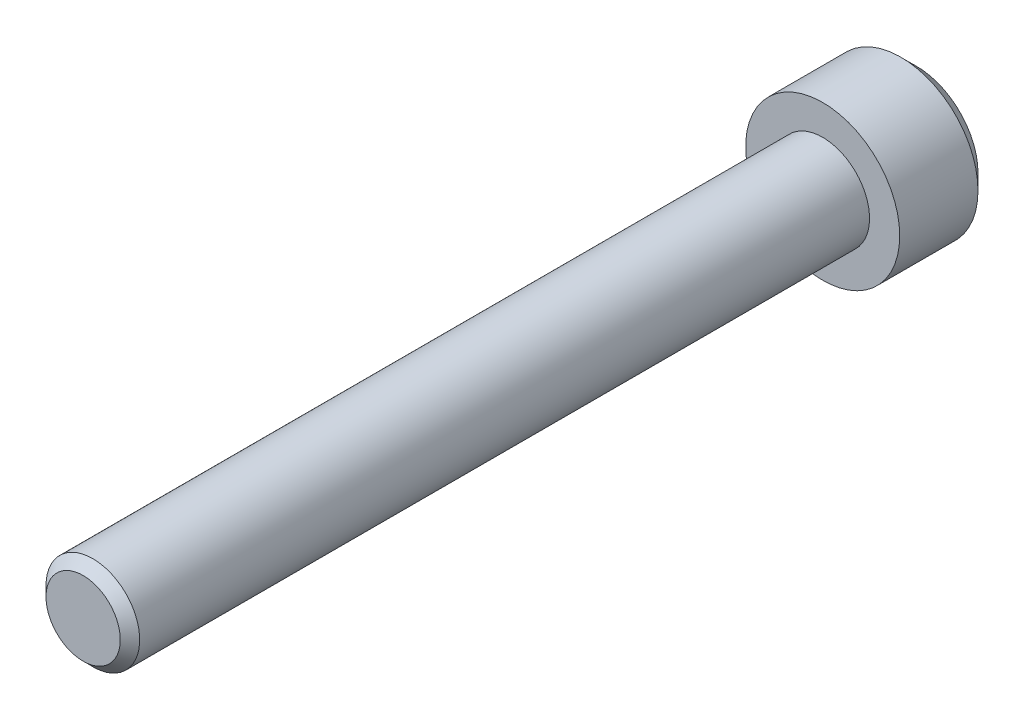
ISO-10303-21;
HEADER;
FILE_DESCRIPTION(('STEP AP214'),'2;1');
FILE_NAME('part.step','',(''),(''),'','','');
FILE_SCHEMA(('AUTOMOTIVE_DESIGN { 1 0 10303 214 1 1 1 1 }'));
ENDSEC;
DATA;
#1=APPLICATION_CONTEXT('core data for automotive mechanical design processes');
#2=APPLICATION_PROTOCOL_DEFINITION('international standard','automotive_design',2000,#1);
#3=PRODUCT_CONTEXT('',#1,'mechanical');
#4=PRODUCT('Part','Part','',(#3));
#5=PRODUCT_RELATED_PRODUCT_CATEGORY('part','',(#4));
#6=PRODUCT_DEFINITION_FORMATION('','',#4);
#7=PRODUCT_DEFINITION_CONTEXT('part definition',#1,'design');
#8=PRODUCT_DEFINITION('design','',#6,#7);
#9=PRODUCT_DEFINITION_SHAPE('','',#8);
#10=(LENGTH_UNIT() NAMED_UNIT(*) SI_UNIT(.MILLI.,.METRE.));
#11=(NAMED_UNIT(*) PLANE_ANGLE_UNIT() SI_UNIT($,.RADIAN.));
#12=(NAMED_UNIT(*) SI_UNIT($,.STERADIAN.) SOLID_ANGLE_UNIT());
#13=UNCERTAINTY_MEASURE_WITH_UNIT(LENGTH_MEASURE(1.E-05),#10,'distance_accuracy_value','');
#14=(GEOMETRIC_REPRESENTATION_CONTEXT(3) GLOBAL_UNCERTAINTY_ASSIGNED_CONTEXT((#13)) GLOBAL_UNIT_ASSIGNED_CONTEXT((#10,
#11,#12)) REPRESENTATION_CONTEXT('',''));
#15=CARTESIAN_POINT('',(0.,0.,0.));
#16=DIRECTION('',(0.,0.,1.));
#17=DIRECTION('',(1.,0.,0.));
#18=AXIS2_PLACEMENT_3D('',#15,#16,#17);
#19=CARTESIAN_POINT('',(75.6412,46.355,-54.2417));
#20=DIRECTION('',(0.,0.,1.));
#21=DIRECTION('',(1.,0.,0.));
#22=AXIS2_PLACEMENT_3D('',#19,#20,#21);
#23=PLANE('',#22);
#24=DIRECTION('',(0.608447428642477,0.793594182550728,0.));
#25=VECTOR('',#24,1.);
#26=CARTESIAN_POINT('',(77.2159884559992,45.1476121337877,-54.2417));
#27=LINE('',#26,#25);
#28=CARTESIAN_POINT('',(77.9130741655732,46.0568166727753,-54.2417));
#29=VERTEX_POINT('',#28);
#30=CARTESIAN_POINT('',(76.5189027464251,44.2384075947999,-54.2417));
#31=VERTEX_POINT('',#30);
#32=EDGE_CURVE('E131',#29,#31,#27,.F.);
#33=ORIENTED_EDGE('',*,*,#32,.T.);
#34=DIRECTION('',(0.991496436705714,-0.13013383879634,0.));
#35=VECTOR('',#34,1.);
#36=CARTESIAN_POINT('',(75.3829656636386,44.3874992584122,-54.2417));
#37=LINE('',#36,#35);
#38=CARTESIAN_POINT('',(74.2470285808521,44.5365909220243,-54.2417));
#39=VERTEX_POINT('',#38);
#40=EDGE_CURVE('E135',#31,#39,#37,.F.);
#41=ORIENTED_EDGE('',*,*,#40,.T.);
#42=DIRECTION('',(0.383049008063238,-0.923728021347068,0.));
#43=VECTOR('',#42,1.);
#44=CARTESIAN_POINT('',(73.8081772076394,45.5948871246245,-54.2417));
#45=LINE('',#44,#43);
#46=CARTESIAN_POINT('',(73.369325834427,46.6531833272247,-54.2417));
#47=VERTEX_POINT('',#46);
#48=EDGE_CURVE('E83',#39,#47,#45,.F.);
#49=ORIENTED_EDGE('',*,*,#48,.T.);
#50=DIRECTION('',(-0.608447428642477,-0.793594182550728,0.));
#51=VECTOR('',#50,1.);
#52=CARTESIAN_POINT('',(74.066411544001,47.5623878662123,-54.2417));
#53=LINE('',#52,#51);
#54=CARTESIAN_POINT('',(74.7634972535751,48.4715924052002,-54.2417));
#55=VERTEX_POINT('',#54);
#56=EDGE_CURVE('E66',#47,#55,#53,.F.);
#57=ORIENTED_EDGE('',*,*,#56,.T.);
#58=DIRECTION('',(-0.991496436705714,0.13013383879634,0.));
#59=VECTOR('',#58,1.);
#60=CARTESIAN_POINT('',(75.8994343363616,48.3225007415878,-54.2417));
#61=LINE('',#60,#59);
#62=CARTESIAN_POINT('',(77.0353714191481,48.1734090779756,-54.2417));
#63=VERTEX_POINT('',#62);
#64=EDGE_CURVE('E71',#55,#63,#61,.F.);
#65=ORIENTED_EDGE('',*,*,#64,.T.);
#66=DIRECTION('',(-0.383049008063237,0.923728021347068,0.));
#67=VECTOR('',#66,1.);
#68=CARTESIAN_POINT('',(77.4742227923606,47.1151128753755,-54.2417));
#69=LINE('',#68,#67);
#70=EDGE_CURVE('E127',#63,#29,#69,.F.);
#71=ORIENTED_EDGE('',*,*,#70,.T.);
#72=EDGE_LOOP('',(#33,#41,#49,#57,#65,#71));
#73=FACE_BOUND('',#72,.T.);
#74=ADVANCED_FACE('F16',(#73),#23,.F.);
#75=CARTESIAN_POINT('',(75.8994343363616,48.3225007415878,-55.3847));
#76=DIRECTION('',(0.13013383879634,0.991496436705714,0.));
#77=DIRECTION('',(-0.991496436705714,0.13013383879634,0.));
#78=AXIS2_PLACEMENT_3D('',#75,#76,#77);
#79=PLANE('',#78);
#80=DIRECTION('',(0.,0.,1.));
#81=VECTOR('',#80,1.);
#82=CARTESIAN_POINT('',(74.7634972535751,48.4715924052002,-55.3847));
#83=LINE('',#82,#81);
#84=CARTESIAN_POINT('',(74.7634972535751,48.4715924052002,-56.5277));
#85=VERTEX_POINT('',#84);
#86=EDGE_CURVE('E73',#55,#85,#83,.F.);
#87=ORIENTED_EDGE('',*,*,#86,.T.);
#88=DIRECTION('',(-0.991496436705721,0.13013383879629,0.));
#89=VECTOR('',#88,1.);
#90=CARTESIAN_POINT('',(77.0353714191482,48.1734090779757,-56.5277));
#91=LINE('',#90,#89);
#92=CARTESIAN_POINT('',(77.0353714191481,48.1734090779756,-56.5277));
#93=VERTEX_POINT('',#92);
#94=EDGE_CURVE('E125',#93,#85,#91,.T.);
#95=ORIENTED_EDGE('',*,*,#94,.F.);
#96=DIRECTION('',(0.,0.,1.));
#97=VECTOR('',#96,1.);
#98=CARTESIAN_POINT('',(77.035371419148,48.1734090779756,-55.3847));
#99=LINE('',#98,#97);
#100=EDGE_CURVE('E76',#93,#63,#99,.T.);
#101=ORIENTED_EDGE('',*,*,#100,.T.);
#102=ORIENTED_EDGE('',*,*,#64,.F.);
#103=EDGE_LOOP('',(#87,#95,#101,#102));
#104=FACE_BOUND('',#103,.T.);
#105=ADVANCED_FACE('F72',(#104),#79,.F.);
#106=CARTESIAN_POINT('',(74.066411544001,47.5623878662123,-55.3847));
#107=DIRECTION('',(-0.793594182550728,0.608447428642477,0.));
#108=DIRECTION('',(-0.608447428642477,-0.793594182550728,0.));
#109=AXIS2_PLACEMENT_3D('',#106,#107,#108);
#110=PLANE('',#109);
#111=DIRECTION('',(0.,0.,1.));
#112=VECTOR('',#111,1.);
#113=CARTESIAN_POINT('',(73.3693258344268,46.6531833272246,-55.3847));
#114=LINE('',#113,#112);
#115=CARTESIAN_POINT('',(73.369325834427,46.6531833272247,-56.5277));
#116=VERTEX_POINT('',#115);
#117=EDGE_CURVE('E85',#47,#116,#114,.F.);
#118=ORIENTED_EDGE('',*,*,#117,.T.);
#119=DIRECTION('',(-0.608447428642512,-0.793594182550701,0.));
#120=VECTOR('',#119,1.);
#121=CARTESIAN_POINT('',(74.7634972535751,48.4715924052002,-56.5277));
#122=LINE('',#121,#120);
#123=EDGE_CURVE('E89',#85,#116,#122,.T.);
#124=ORIENTED_EDGE('',*,*,#123,.F.);
#125=ORIENTED_EDGE('',*,*,#86,.F.);
#126=ORIENTED_EDGE('',*,*,#56,.F.);
#127=EDGE_LOOP('',(#118,#124,#125,#126));
#128=FACE_BOUND('',#127,.T.);
#129=ADVANCED_FACE('F87',(#128),#110,.F.);
#130=CARTESIAN_POINT('',(73.8081772076394,45.5948871246245,-55.3847));
#131=DIRECTION('',(-0.923728021347068,-0.383049008063238,0.));
#132=DIRECTION('',(0.383049008063238,-0.923728021347068,0.));
#133=AXIS2_PLACEMENT_3D('',#130,#131,#132);
#134=PLANE('',#133);
#135=DIRECTION('',(0.,0.,1.));
#136=VECTOR('',#135,1.);
#137=CARTESIAN_POINT('',(74.2470285808521,44.5365909220245,-55.3847));
#138=LINE('',#137,#136);
#139=CARTESIAN_POINT('',(74.2470285808521,44.5365909220243,-56.5277));
#140=VERTEX_POINT('',#139);
#141=EDGE_CURVE('E137',#39,#140,#138,.F.);
#142=ORIENTED_EDGE('',*,*,#141,.T.);
#143=DIRECTION('',(0.383049008063221,-0.923728021347075,0.));
#144=VECTOR('',#143,1.);
#145=CARTESIAN_POINT('',(73.369325834427,46.6531833272247,-56.5277));
#146=LINE('',#145,#144);
#147=EDGE_CURVE('E121',#116,#140,#146,.T.);
#148=ORIENTED_EDGE('',*,*,#147,.F.);
#149=ORIENTED_EDGE('',*,*,#117,.F.);
#150=ORIENTED_EDGE('',*,*,#48,.F.);
#151=EDGE_LOOP('',(#142,#148,#149,#150));
#152=FACE_BOUND('',#151,.T.);
#153=ADVANCED_FACE('F141',(#152),#134,.F.);
#154=CARTESIAN_POINT('',(75.3829656636386,44.3874992584122,-55.3847));
#155=DIRECTION('',(-0.13013383879634,-0.991496436705714,0.));
#156=DIRECTION('',(0.991496436705714,-0.13013383879634,0.));
#157=AXIS2_PLACEMENT_3D('',#154,#155,#156);
#158=PLANE('',#157);
#159=DIRECTION('',(0.,0.,1.));
#160=VECTOR('',#159,1.);
#161=CARTESIAN_POINT('',(76.5189027464251,44.2384075947998,-55.3847));
#162=LINE('',#161,#160);
#163=CARTESIAN_POINT('',(76.5189027464251,44.2384075947999,-56.5277));
#164=VERTEX_POINT('',#163);
#165=EDGE_CURVE('E133',#31,#164,#162,.F.);
#166=ORIENTED_EDGE('',*,*,#165,.T.);
#167=DIRECTION('',(0.99149643670572,-0.130133838796296,0.));
#168=VECTOR('',#167,1.);
#169=CARTESIAN_POINT('',(74.2470285808521,44.5365909220243,-56.5277));
#170=LINE('',#169,#168);
#171=EDGE_CURVE('E118',#140,#164,#170,.T.);
#172=ORIENTED_EDGE('',*,*,#171,.F.);
#173=ORIENTED_EDGE('',*,*,#141,.F.);
#174=ORIENTED_EDGE('',*,*,#40,.F.);
#175=EDGE_LOOP('',(#166,#172,#173,#174));
#176=FACE_BOUND('',#175,.T.);
#177=ADVANCED_FACE('F151',(#176),#158,.F.);
#178=CARTESIAN_POINT('',(77.2159884559992,45.1476121337877,-55.3847));
#179=DIRECTION('',(0.793594182550728,-0.608447428642477,0.));
#180=DIRECTION('',(0.608447428642477,0.793594182550728,0.));
#181=AXIS2_PLACEMENT_3D('',#178,#179,#180);
#182=PLANE('',#181);
#183=DIRECTION('',(0.,0.,1.));
#184=VECTOR('',#183,1.);
#185=CARTESIAN_POINT('',(77.9130741655732,46.0568166727753,-55.3847));
#186=LINE('',#185,#184);
#187=CARTESIAN_POINT('',(77.9130741655732,46.0568166727753,-56.5277));
#188=VERTEX_POINT('',#187);
#189=EDGE_CURVE('E34',#29,#188,#186,.F.);
#190=ORIENTED_EDGE('',*,*,#189,.T.);
#191=DIRECTION('',(0.608447428642539,0.79359418255068,0.));
#192=VECTOR('',#191,1.);
#193=CARTESIAN_POINT('',(76.5189027464251,44.2384075947998,-56.5277));
#194=LINE('',#193,#192);
#195=EDGE_CURVE('E115',#164,#188,#194,.T.);
#196=ORIENTED_EDGE('',*,*,#195,.F.);
#197=ORIENTED_EDGE('',*,*,#165,.F.);
#198=ORIENTED_EDGE('',*,*,#32,.F.);
#199=EDGE_LOOP('',(#190,#196,#197,#198));
#200=FACE_BOUND('',#199,.T.);
#201=ADVANCED_FACE('F149',(#200),#182,.F.);
#202=CARTESIAN_POINT('',(77.4742227923606,47.1151128753755,-55.3847));
#203=DIRECTION('',(0.923728021347068,0.383049008063237,0.));
#204=DIRECTION('',(-0.383049008063237,0.923728021347068,0.));
#205=AXIS2_PLACEMENT_3D('',#202,#203,#204);
#206=PLANE('',#205);
#207=ORIENTED_EDGE('',*,*,#100,.F.);
#208=DIRECTION('',(-0.383049008063216,0.923728021347077,0.));
#209=VECTOR('',#208,1.);
#210=CARTESIAN_POINT('',(77.9130741655733,46.0568166727753,-56.5277));
#211=LINE('',#210,#209);
#212=EDGE_CURVE('E106',#188,#93,#211,.T.);
#213=ORIENTED_EDGE('',*,*,#212,.F.);
#214=ORIENTED_EDGE('',*,*,#189,.F.);
#215=ORIENTED_EDGE('',*,*,#70,.F.);
#216=EDGE_LOOP('',(#207,#213,#214,#215));
#217=FACE_BOUND('',#216,.T.);
#218=ADVANCED_FACE('F147',(#217),#206,.F.);
#219=CARTESIAN_POINT('',(75.6412,46.355,-56.5277));
#220=DIRECTION('',(0.,0.,-1.));
#221=DIRECTION('',(-1.,0.,0.));
#222=AXIS2_PLACEMENT_3D('',#219,#220,#221);
#223=PLANE('',#222);
#224=CARTESIAN_POINT('',(75.6412,46.355,-56.5277000007427));
#225=DIRECTION('',(0.,0.,1.));
#226=DIRECTION('',(1.,0.,0.));
#227=AXIS2_PLACEMENT_3D('',#224,#225,#226);
#228=CIRCLE('',#227,3.17500000071682);
#229=CARTESIAN_POINT('',(78.8162000007168,46.355,-56.5277000007427));
#230=VERTEX_POINT('',#229);
#231=EDGE_CURVE('E19',#230,#230,#228,.T.);
#232=ORIENTED_EDGE('',*,*,#231,.F.);
#233=EDGE_LOOP('',(#232));
#234=FACE_BOUND('',#233,.T.);
#235=ORIENTED_EDGE('',*,*,#195,.T.);
#236=ORIENTED_EDGE('',*,*,#212,.T.);
#237=ORIENTED_EDGE('',*,*,#94,.T.);
#238=ORIENTED_EDGE('',*,*,#123,.T.);
#239=ORIENTED_EDGE('',*,*,#147,.T.);
#240=ORIENTED_EDGE('',*,*,#171,.T.);
#241=EDGE_LOOP('',(#235,#236,#237,#238,#239,#240));
#242=FACE_BOUND('',#241,.T.);
#243=ADVANCED_FACE('F145',(#234,#242),#223,.T.);
#244=CARTESIAN_POINT('',(75.6412,46.355,-55.7339500002172));
#245=DIRECTION('',(0.,0.,1.));
#246=DIRECTION('',(1.,0.,0.));
#247=AXIS2_PLACEMENT_3D('',#244,#245,#246);
#248=CONICAL_SURFACE('',#247,3.96874999982188,0.785398162502687);
#249=CARTESIAN_POINT('',(75.6412,46.355,-55.73395));
#250=DIRECTION('',(0.,0.,1.));
#251=DIRECTION('',(1.,0.,0.));
#252=AXIS2_PLACEMENT_3D('',#249,#250,#251);
#253=CIRCLE('',#252,3.96875);
#254=CARTESIAN_POINT('',(79.60995,46.355,-55.73395));
#255=VERTEX_POINT('',#254);
#256=EDGE_CURVE('E98',#255,#255,#253,.T.);
#257=ORIENTED_EDGE('',*,*,#256,.F.);
#258=EDGE_LOOP('',(#257));
#259=FACE_BOUND('',#258,.T.);
#260=ORIENTED_EDGE('',*,*,#231,.T.);
#261=EDGE_LOOP('',(#260));
#262=FACE_BOUND('',#261,.T.);
#263=ADVANCED_FACE('F182',(#259,#262),#248,.T.);
#264=CARTESIAN_POINT('',(117.726911175833,59.055,-13.6017));
#265=DIRECTION('',(0.,0.,-1.));
#266=DIRECTION('',(0.,1.,0.));
#267=AXIS2_PLACEMENT_3D('',#264,#265,#266);
#268=PLANE('',#267);
#269=CARTESIAN_POINT('',(75.6412,46.355,-13.6017000000379));
#270=DIRECTION('',(0.,0.,-1.));
#271=DIRECTION('',(-1.,0.,0.));
#272=AXIS2_PLACEMENT_3D('',#269,#270,#271);
#273=CIRCLE('',#272,1.91300000005183);
#274=CARTESIAN_POINT('',(73.7281999999482,46.355,-13.6017000000379));
#275=VERTEX_POINT('',#274);
#276=EDGE_CURVE('E96',#275,#275,#273,.T.);
#277=ORIENTED_EDGE('',*,*,#276,.F.);
#278=EDGE_LOOP('',(#277));
#279=FACE_BOUND('',#278,.T.);
#280=ADVANCED_FACE('F179',(#279),#268,.F.);
#281=CARTESIAN_POINT('',(75.6412,46.355,-51.7017));
#282=DIRECTION('',(0.,0.,1.));
#283=DIRECTION('',(1.,0.,0.));
#284=AXIS2_PLACEMENT_3D('',#281,#282,#283);
#285=CYLINDRICAL_SURFACE('',#284,3.96875);
#286=ORIENTED_EDGE('',*,*,#256,.T.);
#287=EDGE_LOOP('',(#286));
#288=FACE_BOUND('',#287,.T.);
#289=CARTESIAN_POINT('',(75.6412,46.355,-51.7017));
#290=DIRECTION('',(0.,0.,1.));
#291=DIRECTION('',(1.,0.,0.));
#292=AXIS2_PLACEMENT_3D('',#289,#290,#291);
#293=CIRCLE('',#292,3.96875);
#294=CARTESIAN_POINT('',(79.60995,46.355,-51.7017));
#295=VERTEX_POINT('',#294);
#296=EDGE_CURVE('E94',#295,#295,#293,.T.);
#297=ORIENTED_EDGE('',*,*,#296,.F.);
#298=EDGE_LOOP('',(#297));
#299=FACE_BOUND('',#298,.T.);
#300=ADVANCED_FACE('F176',(#288,#299),#285,.T.);
#301=CARTESIAN_POINT('',(75.6412,46.355,-14.1016999999692));
#302=DIRECTION('',(0.,0.,-1.));
#303=DIRECTION('',(-1.,0.,0.));
#304=AXIS2_PLACEMENT_3D('',#301,#302,#303);
#305=CONICAL_SURFACE('',#304,2.41300000004001,0.785398163454292);
#306=ORIENTED_EDGE('',*,*,#276,.T.);
#307=EDGE_LOOP('',(#306));
#308=FACE_BOUND('',#307,.T.);
#309=CARTESIAN_POINT('',(75.6412,46.355,-14.1017));
#310=DIRECTION('',(0.,0.,-1.));
#311=DIRECTION('',(-1.,0.,0.));
#312=AXIS2_PLACEMENT_3D('',#309,#310,#311);
#313=CIRCLE('',#312,2.413);
#314=CARTESIAN_POINT('',(73.2282,46.355,-14.1017));
#315=VERTEX_POINT('',#314);
#316=EDGE_CURVE('E25',#315,#315,#313,.T.);
#317=ORIENTED_EDGE('',*,*,#316,.F.);
#318=EDGE_LOOP('',(#317));
#319=FACE_BOUND('',#318,.T.);
#320=ADVANCED_FACE('F169',(#308,#319),#305,.T.);
#321=CARTESIAN_POINT('',(75.6412,46.355,-51.7017));
#322=DIRECTION('',(0.,0.,1.));
#323=DIRECTION('',(1.,0.,0.));
#324=AXIS2_PLACEMENT_3D('',#321,#322,#323);
#325=PLANE('',#324);
#326=CARTESIAN_POINT('',(75.6412,46.355,-51.7017));
#327=DIRECTION('',(0.,0.,-1.));
#328=DIRECTION('',(-1.,0.,0.));
#329=AXIS2_PLACEMENT_3D('',#326,#327,#328);
#330=CIRCLE('',#329,2.413);
#331=CARTESIAN_POINT('',(73.2282,46.355,-51.7017));
#332=VERTEX_POINT('',#331);
#333=EDGE_CURVE('E10',#332,#332,#330,.F.);
#334=ORIENTED_EDGE('',*,*,#333,.F.);
#335=EDGE_LOOP('',(#334));
#336=FACE_BOUND('',#335,.T.);
#337=ORIENTED_EDGE('',*,*,#296,.T.);
#338=EDGE_LOOP('',(#337));
#339=FACE_BOUND('',#338,.T.);
#340=ADVANCED_FACE('F163',(#336,#339),#325,.T.);
#341=CARTESIAN_POINT('',(75.6412,46.355,-51.7017));
#342=DIRECTION('',(0.,0.,-1.));
#343=DIRECTION('',(-1.,0.,0.));
#344=AXIS2_PLACEMENT_3D('',#341,#342,#343);
#345=CYLINDRICAL_SURFACE('',#344,2.413);
#346=ORIENTED_EDGE('',*,*,#333,.T.);
#347=EDGE_LOOP('',(#346));
#348=FACE_BOUND('',#347,.T.);
#349=ORIENTED_EDGE('',*,*,#316,.T.);
#350=EDGE_LOOP('',(#349));
#351=FACE_BOUND('',#350,.T.);
#352=ADVANCED_FACE('F161',(#348,#351),#345,.T.);
#353=CLOSED_SHELL('',(#74,#105,#129,#153,#177,#201,#218,#243,#263,#280,#300,#320,#340,#352));
#354=MANIFOLD_SOLID_BREP('B1',#353);
#355=ADVANCED_BREP_SHAPE_REPRESENTATION('',(#18,#354),#14);
#356=SHAPE_DEFINITION_REPRESENTATION(#9,#355);
ENDSEC;
END-ISO-10303-21;
